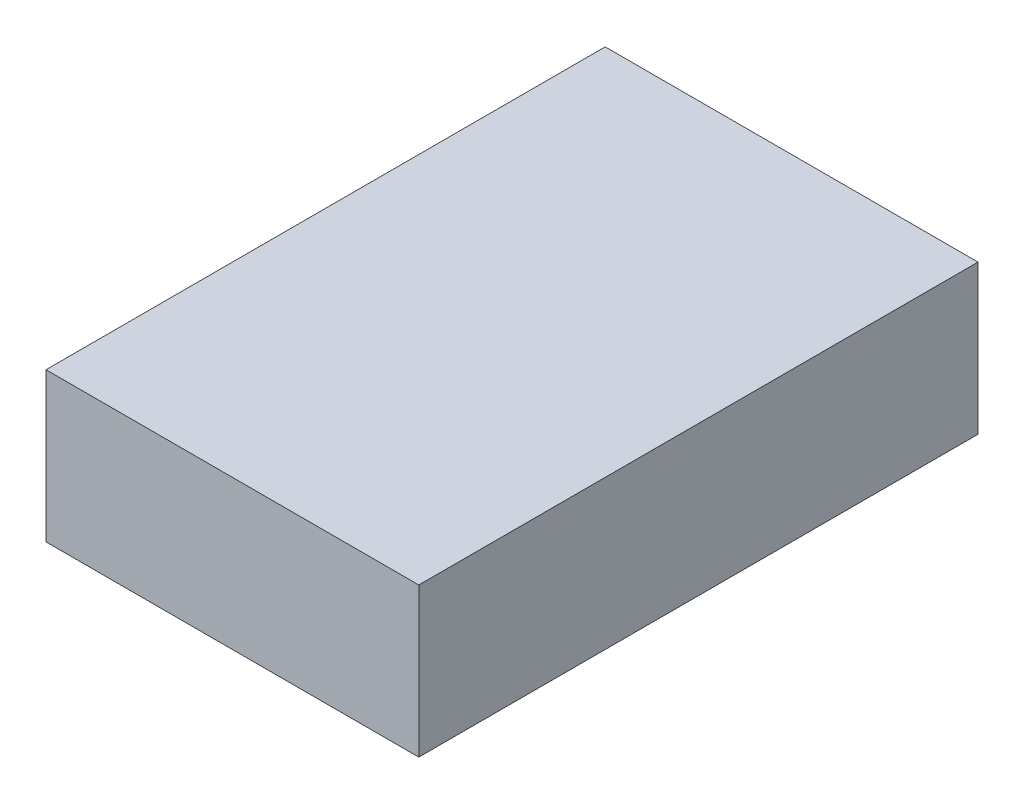
ISO-10303-21;
HEADER;
FILE_DESCRIPTION(('STEP AP214'),'2;1');
FILE_NAME('part.step','',(''),(''),'','','');
FILE_SCHEMA(('AUTOMOTIVE_DESIGN { 1 0 10303 214 1 1 1 1 }'));
ENDSEC;
DATA;
#1=APPLICATION_CONTEXT('core data for automotive mechanical design processes');
#2=APPLICATION_PROTOCOL_DEFINITION('international standard','automotive_design',2000,#1);
#3=PRODUCT_CONTEXT('',#1,'mechanical');
#4=PRODUCT('Part','Part','',(#3));
#5=PRODUCT_RELATED_PRODUCT_CATEGORY('part','',(#4));
#6=PRODUCT_DEFINITION_FORMATION('','',#4);
#7=PRODUCT_DEFINITION_CONTEXT('part definition',#1,'design');
#8=PRODUCT_DEFINITION('design','',#6,#7);
#9=PRODUCT_DEFINITION_SHAPE('','',#8);
#10=(LENGTH_UNIT() NAMED_UNIT(*) SI_UNIT(.MILLI.,.METRE.));
#11=(NAMED_UNIT(*) PLANE_ANGLE_UNIT() SI_UNIT($,.RADIAN.));
#12=(NAMED_UNIT(*) SI_UNIT($,.STERADIAN.) SOLID_ANGLE_UNIT());
#13=UNCERTAINTY_MEASURE_WITH_UNIT(LENGTH_MEASURE(1.E-05),#10,'distance_accuracy_value','');
#14=(GEOMETRIC_REPRESENTATION_CONTEXT(3) GLOBAL_UNCERTAINTY_ASSIGNED_CONTEXT((#13)) GLOBAL_UNIT_ASSIGNED_CONTEXT((#10,
#11,#12)) REPRESENTATION_CONTEXT('',''));
#15=CARTESIAN_POINT('',(0.,0.,0.));
#16=DIRECTION('',(0.,0.,1.));
#17=DIRECTION('',(1.,0.,0.));
#18=AXIS2_PLACEMENT_3D('',#15,#16,#17);
#19=CARTESIAN_POINT('',(1.,0.8,-1.5));
#20=DIRECTION('',(-1.,0.,0.));
#21=DIRECTION('',(0.,0.,1.));
#22=AXIS2_PLACEMENT_3D('',#19,#20,#21);
#23=PLANE('',#22);
#24=DIRECTION('',(0.,0.,-1.));
#25=VECTOR('',#24,1.);
#26=CARTESIAN_POINT('',(1.,0.,-1.5));
#27=LINE('',#26,#25);
#28=CARTESIAN_POINT('',(1.,0.,1.5));
#29=VERTEX_POINT('',#28);
#30=CARTESIAN_POINT('',(1.,0.,-1.5));
#31=VERTEX_POINT('',#30);
#32=EDGE_CURVE('E97',#29,#31,#27,.T.);
#33=ORIENTED_EDGE('',*,*,#32,.T.);
#34=DIRECTION('',(0.,-1.,0.));
#35=VECTOR('',#34,1.);
#36=CARTESIAN_POINT('',(1.,0.8,-1.5));
#37=LINE('',#36,#35);
#38=CARTESIAN_POINT('',(1.,0.8,-1.5));
#39=VERTEX_POINT('',#38);
#40=EDGE_CURVE('E11',#39,#31,#37,.T.);
#41=ORIENTED_EDGE('',*,*,#40,.F.);
#42=DIRECTION('',(0.,0.,-1.));
#43=VECTOR('',#42,1.);
#44=CARTESIAN_POINT('',(1.,0.8,-1.5));
#45=LINE('',#44,#43);
#46=CARTESIAN_POINT('',(1.,0.8,1.5));
#47=VERTEX_POINT('',#46);
#48=EDGE_CURVE('E85',#47,#39,#45,.T.);
#49=ORIENTED_EDGE('',*,*,#48,.F.);
#50=DIRECTION('',(0.,-1.,0.));
#51=VECTOR('',#50,1.);
#52=CARTESIAN_POINT('',(1.,0.8,1.5));
#53=LINE('',#52,#51);
#54=EDGE_CURVE('E93',#47,#29,#53,.T.);
#55=ORIENTED_EDGE('',*,*,#54,.T.);
#56=EDGE_LOOP('',(#33,#41,#49,#55));
#57=FACE_BOUND('',#56,.T.);
#58=ADVANCED_FACE('F34',(#57),#23,.F.);
#59=CARTESIAN_POINT('',(-1.,0.8,-1.5));
#60=DIRECTION('',(0.,0.,1.));
#61=DIRECTION('',(1.,0.,0.));
#62=AXIS2_PLACEMENT_3D('',#59,#60,#61);
#63=PLANE('',#62);
#64=DIRECTION('',(-1.,0.,0.));
#65=VECTOR('',#64,1.);
#66=CARTESIAN_POINT('',(-1.,0.,-1.5));
#67=LINE('',#66,#65);
#68=CARTESIAN_POINT('',(-1.,0.,-1.5));
#69=VERTEX_POINT('',#68);
#70=EDGE_CURVE('E89',#31,#69,#67,.T.);
#71=ORIENTED_EDGE('',*,*,#70,.T.);
#72=DIRECTION('',(0.,-1.,0.));
#73=VECTOR('',#72,1.);
#74=CARTESIAN_POINT('',(-1.,0.8,-1.5));
#75=LINE('',#74,#73);
#76=CARTESIAN_POINT('',(-1.,0.8,-1.5));
#77=VERTEX_POINT('',#76);
#78=EDGE_CURVE('E42',#77,#69,#75,.T.);
#79=ORIENTED_EDGE('',*,*,#78,.F.);
#80=DIRECTION('',(-1.,0.,0.));
#81=VECTOR('',#80,1.);
#82=CARTESIAN_POINT('',(-1.,0.8,-1.5));
#83=LINE('',#82,#81);
#84=EDGE_CURVE('E80',#39,#77,#83,.T.);
#85=ORIENTED_EDGE('',*,*,#84,.F.);
#86=ORIENTED_EDGE('',*,*,#40,.T.);
#87=EDGE_LOOP('',(#71,#79,#85,#86));
#88=FACE_BOUND('',#87,.T.);
#89=ADVANCED_FACE('F88',(#88),#63,.F.);
#90=CARTESIAN_POINT('',(-1.,0.8,-1.5));
#91=DIRECTION('',(1.,0.,0.));
#92=DIRECTION('',(0.,0.,-1.));
#93=AXIS2_PLACEMENT_3D('',#90,#91,#92);
#94=PLANE('',#93);
#95=DIRECTION('',(0.,0.,1.));
#96=VECTOR('',#95,1.);
#97=CARTESIAN_POINT('',(-1.,0.,-1.5));
#98=LINE('',#97,#96);
#99=CARTESIAN_POINT('',(-0.999999999999999,0.,1.5));
#100=VERTEX_POINT('',#99);
#101=EDGE_CURVE('E67',#69,#100,#98,.T.);
#102=ORIENTED_EDGE('',*,*,#101,.T.);
#103=DIRECTION('',(0.,-1.,0.));
#104=VECTOR('',#103,1.);
#105=CARTESIAN_POINT('',(-0.999999999999999,0.8,1.5));
#106=LINE('',#105,#104);
#107=CARTESIAN_POINT('',(-0.999999999999999,0.8,1.5));
#108=VERTEX_POINT('',#107);
#109=EDGE_CURVE('E90',#108,#100,#106,.T.);
#110=ORIENTED_EDGE('',*,*,#109,.F.);
#111=DIRECTION('',(0.,0.,1.));
#112=VECTOR('',#111,1.);
#113=CARTESIAN_POINT('',(-1.,0.8,-1.5));
#114=LINE('',#113,#112);
#115=EDGE_CURVE('E83',#77,#108,#114,.T.);
#116=ORIENTED_EDGE('',*,*,#115,.F.);
#117=ORIENTED_EDGE('',*,*,#78,.T.);
#118=EDGE_LOOP('',(#102,#110,#116,#117));
#119=FACE_BOUND('',#118,.T.);
#120=ADVANCED_FACE('F91',(#119),#94,.F.);
#121=CARTESIAN_POINT('',(-0.999999999999999,0.8,1.5));
#122=DIRECTION('',(0.,0.,-1.));
#123=DIRECTION('',(-1.,0.,0.));
#124=AXIS2_PLACEMENT_3D('',#121,#122,#123);
#125=PLANE('',#124);
#126=DIRECTION('',(1.,0.,0.));
#127=VECTOR('',#126,1.);
#128=CARTESIAN_POINT('',(-0.999999999999999,0.,1.5));
#129=LINE('',#128,#127);
#130=EDGE_CURVE('E73',#100,#29,#129,.T.);
#131=ORIENTED_EDGE('',*,*,#130,.T.);
#132=ORIENTED_EDGE('',*,*,#54,.F.);
#133=DIRECTION('',(1.,0.,0.));
#134=VECTOR('',#133,1.);
#135=CARTESIAN_POINT('',(-0.999999999999999,0.8,1.5));
#136=LINE('',#135,#134);
#137=EDGE_CURVE('E50',#108,#47,#136,.T.);
#138=ORIENTED_EDGE('',*,*,#137,.F.);
#139=ORIENTED_EDGE('',*,*,#109,.T.);
#140=EDGE_LOOP('',(#131,#132,#138,#139));
#141=FACE_BOUND('',#140,.T.);
#142=ADVANCED_FACE('F104',(#141),#125,.F.);
#143=CARTESIAN_POINT('',(0.,0.8,0.));
#144=DIRECTION('',(0.,1.,0.));
#145=DIRECTION('',(0.,0.,1.));
#146=AXIS2_PLACEMENT_3D('',#143,#144,#145);
#147=PLANE('',#146);
#148=ORIENTED_EDGE('',*,*,#48,.T.);
#149=ORIENTED_EDGE('',*,*,#84,.T.);
#150=ORIENTED_EDGE('',*,*,#115,.T.);
#151=ORIENTED_EDGE('',*,*,#137,.T.);
#152=EDGE_LOOP('',(#148,#149,#150,#151));
#153=FACE_BOUND('',#152,.T.);
#154=ADVANCED_FACE('F81',(#153),#147,.T.);
#155=CARTESIAN_POINT('',(0.,0.,0.));
#156=DIRECTION('',(0.,1.,0.));
#157=DIRECTION('',(0.,0.,1.));
#158=AXIS2_PLACEMENT_3D('',#155,#156,#157);
#159=PLANE('',#158);
#160=ORIENTED_EDGE('',*,*,#32,.F.);
#161=ORIENTED_EDGE('',*,*,#130,.F.);
#162=ORIENTED_EDGE('',*,*,#101,.F.);
#163=ORIENTED_EDGE('',*,*,#70,.F.);
#164=EDGE_LOOP('',(#160,#161,#162,#163));
#165=FACE_BOUND('',#164,.T.);
#166=ADVANCED_FACE('F107',(#165),#159,.F.);
#167=CLOSED_SHELL('',(#58,#89,#120,#142,#154,#166));
#168=MANIFOLD_SOLID_BREP('B2',#167);
#169=ADVANCED_BREP_SHAPE_REPRESENTATION('',(#18,#168),#14);
#170=SHAPE_DEFINITION_REPRESENTATION(#9,#169);
ENDSEC;
END-ISO-10303-21;
